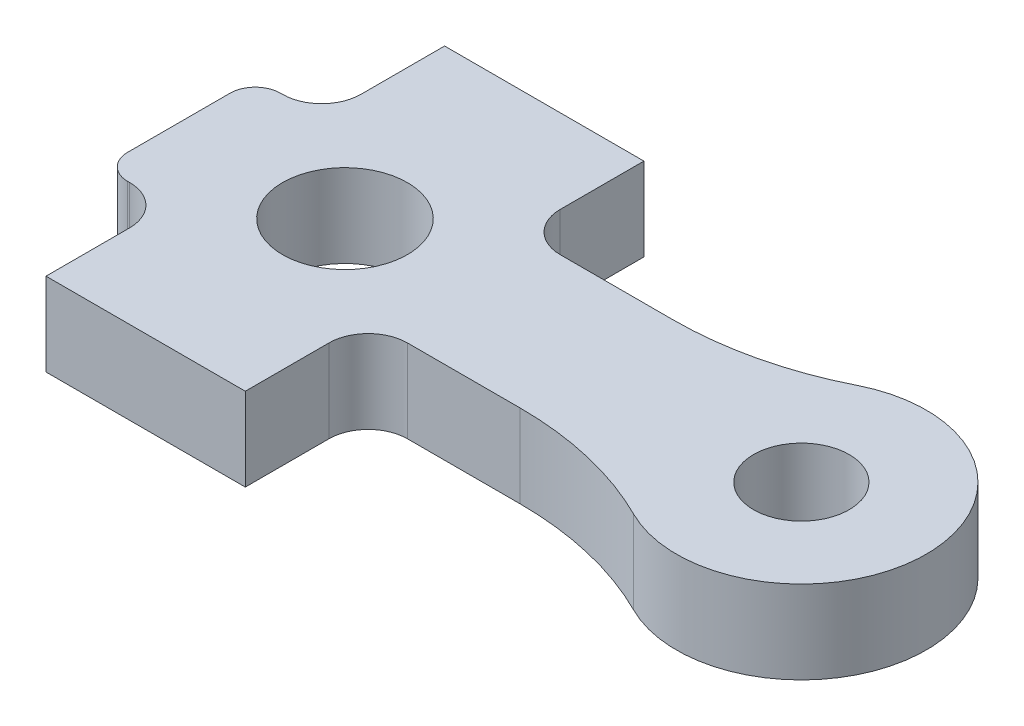
ISO-10303-21;
HEADER;
FILE_DESCRIPTION(('STEP AP214'),'2;1');
FILE_NAME('part.step','',(''),(''),'','','');
FILE_SCHEMA(('AUTOMOTIVE_DESIGN { 1 0 10303 214 1 1 1 1 }'));
ENDSEC;
DATA;
#1=APPLICATION_CONTEXT('core data for automotive mechanical design processes');
#2=APPLICATION_PROTOCOL_DEFINITION('international standard','automotive_design',2000,#1);
#3=PRODUCT_CONTEXT('',#1,'mechanical');
#4=PRODUCT('Part','Part','',(#3));
#5=PRODUCT_RELATED_PRODUCT_CATEGORY('part','',(#4));
#6=PRODUCT_DEFINITION_FORMATION('','',#4);
#7=PRODUCT_DEFINITION_CONTEXT('part definition',#1,'design');
#8=PRODUCT_DEFINITION('design','',#6,#7);
#9=PRODUCT_DEFINITION_SHAPE('','',#8);
#10=(LENGTH_UNIT() NAMED_UNIT(*) SI_UNIT(.MILLI.,.METRE.));
#11=(NAMED_UNIT(*) PLANE_ANGLE_UNIT() SI_UNIT($,.RADIAN.));
#12=(NAMED_UNIT(*) SI_UNIT($,.STERADIAN.) SOLID_ANGLE_UNIT());
#13=UNCERTAINTY_MEASURE_WITH_UNIT(LENGTH_MEASURE(1.E-05),#10,'distance_accuracy_value','');
#14=(GEOMETRIC_REPRESENTATION_CONTEXT(3) GLOBAL_UNCERTAINTY_ASSIGNED_CONTEXT((#13)) GLOBAL_UNIT_ASSIGNED_CONTEXT((#10,
#11,#12)) REPRESENTATION_CONTEXT('',''));
#15=CARTESIAN_POINT('',(0.,0.,0.));
#16=DIRECTION('',(0.,0.,1.));
#17=DIRECTION('',(1.,0.,0.));
#18=AXIS2_PLACEMENT_3D('',#15,#16,#17);
#19=CARTESIAN_POINT('',(7.9375,3.175,0.));
#20=DIRECTION('',(0.,1.,0.));
#21=DIRECTION('',(1.,0.,0.));
#22=AXIS2_PLACEMENT_3D('',#19,#20,#21);
#23=PLANE('',#22);
#24=CARTESIAN_POINT('',(17.4498,3.175,0.));
#25=DIRECTION('',(0.,-1.,0.));
#26=DIRECTION('',(1.,0.,0.));
#27=AXIS2_PLACEMENT_3D('',#24,#25,#26);
#28=CIRCLE('',#27,1.8288);
#29=CARTESIAN_POINT('',(15.621,3.175,0.));
#30=VERTEX_POINT('',#29);
#31=EDGE_CURVE('E246',#30,#30,#28,.T.);
#32=ORIENTED_EDGE('',*,*,#31,.T.);
#33=EDGE_LOOP('',(#32));
#34=FACE_BOUND('',#33,.T.);
#35=CARTESIAN_POINT('',(0.,3.175,0.));
#36=DIRECTION('',(0.,-1.,0.));
#37=DIRECTION('',(1.,0.,0.));
#38=AXIS2_PLACEMENT_3D('',#35,#36,#37);
#39=CIRCLE('',#38,2.3876);
#40=CARTESIAN_POINT('',(-2.3876,3.175,0.));
#41=VERTEX_POINT('',#40);
#42=EDGE_CURVE('E245',#41,#41,#39,.T.);
#43=ORIENTED_EDGE('',*,*,#42,.T.);
#44=EDGE_LOOP('',(#43));
#45=FACE_BOUND('',#44,.T.);
#46=CARTESIAN_POINT('',(-5.3848,3.175,-1.9558));
#47=DIRECTION('',(0.,-1.,0.));
#48=DIRECTION('',(-0.707106781186547,0.,-0.707106781186548));
#49=AXIS2_PLACEMENT_3D('',#46,#47,#48);
#50=CIRCLE('',#49,0.9652);
#51=CARTESIAN_POINT('',(-6.35,3.175,-1.9558));
#52=VERTEX_POINT('',#51);
#53=CARTESIAN_POINT('',(-5.3848,3.175,-2.921));
#54=VERTEX_POINT('',#53);
#55=EDGE_CURVE('E250',#52,#54,#50,.T.);
#56=ORIENTED_EDGE('',*,*,#55,.F.);
#57=DIRECTION('',(0.,0.,1.));
#58=VECTOR('',#57,1.);
#59=CARTESIAN_POINT('',(-6.35,3.175,-2.921));
#60=LINE('',#59,#58);
#61=CARTESIAN_POINT('',(-6.35,3.175,1.9558));
#62=VERTEX_POINT('',#61);
#63=EDGE_CURVE('E298',#52,#62,#60,.T.);
#64=ORIENTED_EDGE('',*,*,#63,.T.);
#65=CARTESIAN_POINT('',(-5.3848,3.175,1.9558));
#66=DIRECTION('',(0.,-1.,0.));
#67=DIRECTION('',(-0.707106781186547,0.,0.707106781186548));
#68=AXIS2_PLACEMENT_3D('',#65,#66,#67);
#69=CIRCLE('',#68,0.9652);
#70=CARTESIAN_POINT('',(-5.3848,3.175,2.921));
#71=VERTEX_POINT('',#70);
#72=EDGE_CURVE('E369',#71,#62,#69,.T.);
#73=ORIENTED_EDGE('',*,*,#72,.F.);
#74=DIRECTION('',(1.,0.,0.));
#75=VECTOR('',#74,1.);
#76=CARTESIAN_POINT('',(-6.35,3.175,2.921));
#77=LINE('',#76,#75);
#78=CARTESIAN_POINT('',(-5.31,3.175,2.921));
#79=VERTEX_POINT('',#78);
#80=EDGE_CURVE('E11',#71,#79,#77,.T.);
#81=ORIENTED_EDGE('',*,*,#80,.T.);
#82=CARTESIAN_POINT('',(-5.31,3.175,4.421));
#83=DIRECTION('',(0.,1.,0.));
#84=DIRECTION('',(0.707106781186548,0.,-0.707106781186548));
#85=AXIS2_PLACEMENT_3D('',#82,#83,#84);
#86=CIRCLE('',#85,1.5);
#87=CARTESIAN_POINT('',(-3.81,3.175,4.421));
#88=VERTEX_POINT('',#87);
#89=EDGE_CURVE('E419',#88,#79,#86,.T.);
#90=ORIENTED_EDGE('',*,*,#89,.F.);
#91=DIRECTION('',(0.,0.,1.));
#92=VECTOR('',#91,1.);
#93=CARTESIAN_POINT('',(-3.81,3.175,7.62));
#94=LINE('',#93,#92);
#95=CARTESIAN_POINT('',(-3.81,3.175,7.62));
#96=VERTEX_POINT('',#95);
#97=EDGE_CURVE('E240',#88,#96,#94,.T.);
#98=ORIENTED_EDGE('',*,*,#97,.T.);
#99=DIRECTION('',(1.,0.,0.));
#100=VECTOR('',#99,1.);
#101=CARTESIAN_POINT('',(3.81,3.175,7.62));
#102=LINE('',#101,#100);
#103=CARTESIAN_POINT('',(3.81,3.175,7.62));
#104=VERTEX_POINT('',#103);
#105=EDGE_CURVE('E27',#96,#104,#102,.T.);
#106=ORIENTED_EDGE('',*,*,#105,.T.);
#107=DIRECTION('',(0.,0.,-1.));
#108=VECTOR('',#107,1.);
#109=CARTESIAN_POINT('',(3.81,3.175,-7.62));
#110=LINE('',#109,#108);
#111=CARTESIAN_POINT('',(3.81,3.175,4.421));
#112=VERTEX_POINT('',#111);
#113=EDGE_CURVE('E339',#104,#112,#110,.T.);
#114=ORIENTED_EDGE('',*,*,#113,.T.);
#115=CARTESIAN_POINT('',(5.31,3.175,4.421));
#116=DIRECTION('',(0.,1.,0.));
#117=DIRECTION('',(-0.707106781186548,0.,-0.707106781186548));
#118=AXIS2_PLACEMENT_3D('',#115,#116,#117);
#119=CIRCLE('',#118,1.5);
#120=CARTESIAN_POINT('',(5.31,3.175,2.921));
#121=VERTEX_POINT('',#120);
#122=EDGE_CURVE('E320',#121,#112,#119,.T.);
#123=ORIENTED_EDGE('',*,*,#122,.F.);
#124=DIRECTION('',(1.,0.,0.));
#125=VECTOR('',#124,1.);
#126=CARTESIAN_POINT('',(-6.35,3.175,2.921));
#127=LINE('',#126,#125);
#128=CARTESIAN_POINT('',(9.61609244610192,3.175,2.921));
#129=VERTEX_POINT('',#128);
#130=EDGE_CURVE('E214',#121,#129,#127,.T.);
#131=ORIENTED_EDGE('',*,*,#130,.T.);
#132=CARTESIAN_POINT('',(9.61609244610192,3.175,15.621));
#133=DIRECTION('',(0.,1.,0.));
#134=DIRECTION('',(0.230330904529538,0.,-0.973112364744486));
#135=AXIS2_PLACEMENT_3D('',#132,#133,#134);
#136=CIRCLE('',#135,12.7);
#137=CARTESIAN_POINT('',(15.309193866086,3.175,4.26852906976744));
#138=VERTEX_POINT('',#137);
#139=EDGE_CURVE('E209',#138,#129,#136,.T.);
#140=ORIENTED_EDGE('',*,*,#139,.F.);
#141=CARTESIAN_POINT('',(17.4498,3.175,0.));
#142=DIRECTION('',(0.,1.,0.));
#143=DIRECTION('',(1.,0.,0.));
#144=AXIS2_PLACEMENT_3D('',#141,#142,#143);
#145=CIRCLE('',#144,4.7752);
#146=CARTESIAN_POINT('',(15.309193866086,3.175,-4.26852906976744));
#147=VERTEX_POINT('',#146);
#148=EDGE_CURVE('E197',#138,#147,#145,.T.);
#149=ORIENTED_EDGE('',*,*,#148,.T.);
#150=CARTESIAN_POINT('',(9.61609244610192,3.175,-15.621));
#151=DIRECTION('',(0.,1.,0.));
#152=DIRECTION('',(0.230330904529538,0.,0.973112364744486));
#153=AXIS2_PLACEMENT_3D('',#150,#151,#152);
#154=CIRCLE('',#153,12.7);
#155=CARTESIAN_POINT('',(9.61609244610192,3.175,-2.921));
#156=VERTEX_POINT('',#155);
#157=EDGE_CURVE('E329',#156,#147,#154,.T.);
#158=ORIENTED_EDGE('',*,*,#157,.F.);
#159=DIRECTION('',(-1.,0.,0.));
#160=VECTOR('',#159,1.);
#161=CARTESIAN_POINT('',(22.225,3.175,-2.921));
#162=LINE('',#161,#160);
#163=CARTESIAN_POINT('',(5.31,3.175,-2.921));
#164=VERTEX_POINT('',#163);
#165=EDGE_CURVE('E236',#156,#164,#162,.T.);
#166=ORIENTED_EDGE('',*,*,#165,.T.);
#167=CARTESIAN_POINT('',(5.31,3.175,-4.421));
#168=DIRECTION('',(0.,1.,0.));
#169=DIRECTION('',(-0.707106781186548,0.,0.707106781186548));
#170=AXIS2_PLACEMENT_3D('',#167,#168,#169);
#171=CIRCLE('',#170,1.5);
#172=CARTESIAN_POINT('',(3.81,3.175,-4.421));
#173=VERTEX_POINT('',#172);
#174=EDGE_CURVE('E267',#173,#164,#171,.T.);
#175=ORIENTED_EDGE('',*,*,#174,.F.);
#176=DIRECTION('',(0.,0.,-1.));
#177=VECTOR('',#176,1.);
#178=CARTESIAN_POINT('',(3.81,3.175,-7.62));
#179=LINE('',#178,#177);
#180=CARTESIAN_POINT('',(3.81,3.175,-7.62));
#181=VERTEX_POINT('',#180);
#182=EDGE_CURVE('E261',#173,#181,#179,.T.);
#183=ORIENTED_EDGE('',*,*,#182,.T.);
#184=DIRECTION('',(-1.,0.,0.));
#185=VECTOR('',#184,1.);
#186=CARTESIAN_POINT('',(-3.81,3.175,-7.62));
#187=LINE('',#186,#185);
#188=CARTESIAN_POINT('',(-3.81,3.175,-7.62));
#189=VERTEX_POINT('',#188);
#190=EDGE_CURVE('E292',#181,#189,#187,.T.);
#191=ORIENTED_EDGE('',*,*,#190,.T.);
#192=DIRECTION('',(0.,0.,1.));
#193=VECTOR('',#192,1.);
#194=CARTESIAN_POINT('',(-3.81,3.175,7.62));
#195=LINE('',#194,#193);
#196=CARTESIAN_POINT('',(-3.81,3.175,-4.421));
#197=VERTEX_POINT('',#196);
#198=EDGE_CURVE('E293',#189,#197,#195,.T.);
#199=ORIENTED_EDGE('',*,*,#198,.T.);
#200=CARTESIAN_POINT('',(-5.31,3.175,-4.421));
#201=DIRECTION('',(0.,1.,0.));
#202=DIRECTION('',(0.707106781186548,0.,0.707106781186548));
#203=AXIS2_PLACEMENT_3D('',#200,#201,#202);
#204=CIRCLE('',#203,1.5);
#205=CARTESIAN_POINT('',(-5.31,3.175,-2.921));
#206=VERTEX_POINT('',#205);
#207=EDGE_CURVE('E359',#206,#197,#204,.T.);
#208=ORIENTED_EDGE('',*,*,#207,.F.);
#209=DIRECTION('',(-1.,0.,0.));
#210=VECTOR('',#209,1.);
#211=CARTESIAN_POINT('',(22.225,3.175,-2.921));
#212=LINE('',#211,#210);
#213=EDGE_CURVE('E275',#206,#54,#212,.T.);
#214=ORIENTED_EDGE('',*,*,#213,.T.);
#215=EDGE_LOOP('',(#56,#64,#73,#81,#90,#98,#106,#114,#123,#131,#140,#149,#158,#166,#175,#183,
#191,#199,#208,#214));
#216=FACE_BOUND('',#215,.T.);
#217=ADVANCED_FACE('F16',(#34,#45,#216),#23,.T.);
#218=CARTESIAN_POINT('',(-6.35,0.,2.921));
#219=DIRECTION('',(0.,0.,1.));
#220=DIRECTION('',(1.,0.,0.));
#221=AXIS2_PLACEMENT_3D('',#218,#219,#220);
#222=PLANE('',#221);
#223=DIRECTION('',(0.,-1.,0.));
#224=VECTOR('',#223,1.);
#225=CARTESIAN_POINT('',(-5.31,0.,2.921));
#226=LINE('',#225,#224);
#227=CARTESIAN_POINT('',(-5.31,0.,2.921));
#228=VERTEX_POINT('',#227);
#229=EDGE_CURVE('E411',#79,#228,#226,.T.);
#230=ORIENTED_EDGE('',*,*,#229,.F.);
#231=ORIENTED_EDGE('',*,*,#80,.F.);
#232=DIRECTION('',(0.,1.,0.));
#233=VECTOR('',#232,1.);
#234=CARTESIAN_POINT('',(-5.3848,0.,2.921));
#235=LINE('',#234,#233);
#236=CARTESIAN_POINT('',(-5.3848,0.,2.921));
#237=VERTEX_POINT('',#236);
#238=EDGE_CURVE('E352',#237,#71,#235,.T.);
#239=ORIENTED_EDGE('',*,*,#238,.F.);
#240=DIRECTION('',(1.,0.,0.));
#241=VECTOR('',#240,1.);
#242=CARTESIAN_POINT('',(-6.35,0.,2.921));
#243=LINE('',#242,#241);
#244=EDGE_CURVE('E274',#237,#228,#243,.T.);
#245=ORIENTED_EDGE('',*,*,#244,.T.);
#246=EDGE_LOOP('',(#230,#231,#239,#245));
#247=FACE_BOUND('',#246,.T.);
#248=ADVANCED_FACE('F410',(#247),#222,.T.);
#249=CARTESIAN_POINT('',(-3.81,0.,7.62));
#250=DIRECTION('',(0.,0.,1.));
#251=DIRECTION('',(1.,0.,0.));
#252=AXIS2_PLACEMENT_3D('',#249,#250,#251);
#253=PLANE('',#252);
#254=DIRECTION('',(-1.,0.,0.));
#255=VECTOR('',#254,1.);
#256=CARTESIAN_POINT('',(3.81,0.,7.62));
#257=LINE('',#256,#255);
#258=CARTESIAN_POINT('',(3.81,0.,7.62));
#259=VERTEX_POINT('',#258);
#260=CARTESIAN_POINT('',(-3.81,0.,7.62));
#261=VERTEX_POINT('',#260);
#262=EDGE_CURVE('E255',#259,#261,#257,.T.);
#263=ORIENTED_EDGE('',*,*,#262,.F.);
#264=DIRECTION('',(0.,1.,0.));
#265=VECTOR('',#264,1.);
#266=CARTESIAN_POINT('',(3.81,0.,7.62));
#267=LINE('',#266,#265);
#268=EDGE_CURVE('E342',#259,#104,#267,.T.);
#269=ORIENTED_EDGE('',*,*,#268,.T.);
#270=ORIENTED_EDGE('',*,*,#105,.F.);
#271=DIRECTION('',(0.,1.,0.));
#272=VECTOR('',#271,1.);
#273=CARTESIAN_POINT('',(-3.81,0.,7.62));
#274=LINE('',#273,#272);
#275=EDGE_CURVE('E237',#261,#96,#274,.T.);
#276=ORIENTED_EDGE('',*,*,#275,.F.);
#277=EDGE_LOOP('',(#263,#269,#270,#276));
#278=FACE_BOUND('',#277,.T.);
#279=ADVANCED_FACE('F509',(#278),#253,.T.);
#280=CARTESIAN_POINT('',(3.81,0.,7.62));
#281=DIRECTION('',(1.,0.,0.));
#282=DIRECTION('',(0.,1.,0.));
#283=AXIS2_PLACEMENT_3D('',#280,#281,#282);
#284=PLANE('',#283);
#285=DIRECTION('',(0.,-1.,0.));
#286=VECTOR('',#285,1.);
#287=CARTESIAN_POINT('',(3.81,0.,4.421));
#288=LINE('',#287,#286);
#289=CARTESIAN_POINT('',(3.81,0.,4.421));
#290=VERTEX_POINT('',#289);
#291=EDGE_CURVE('E316',#112,#290,#288,.T.);
#292=ORIENTED_EDGE('',*,*,#291,.F.);
#293=ORIENTED_EDGE('',*,*,#113,.F.);
#294=ORIENTED_EDGE('',*,*,#268,.F.);
#295=DIRECTION('',(0.,0.,1.));
#296=VECTOR('',#295,1.);
#297=CARTESIAN_POINT('',(3.81,0.,-7.62));
#298=LINE('',#297,#296);
#299=EDGE_CURVE('E251',#290,#259,#298,.T.);
#300=ORIENTED_EDGE('',*,*,#299,.F.);
#301=EDGE_LOOP('',(#292,#293,#294,#300));
#302=FACE_BOUND('',#301,.T.);
#303=ADVANCED_FACE('F505',(#302),#284,.T.);
#304=CARTESIAN_POINT('',(3.81,0.,-7.62));
#305=DIRECTION('',(0.,0.,-1.));
#306=DIRECTION('',(0.,-1.,0.));
#307=AXIS2_PLACEMENT_3D('',#304,#305,#306);
#308=PLANE('',#307);
#309=DIRECTION('',(1.,0.,0.));
#310=VECTOR('',#309,1.);
#311=CARTESIAN_POINT('',(-3.81,0.,-7.62));
#312=LINE('',#311,#310);
#313=CARTESIAN_POINT('',(-3.81,0.,-7.62));
#314=VERTEX_POINT('',#313);
#315=CARTESIAN_POINT('',(3.81,0.,-7.62));
#316=VERTEX_POINT('',#315);
#317=EDGE_CURVE('E256',#314,#316,#312,.T.);
#318=ORIENTED_EDGE('',*,*,#317,.F.);
#319=DIRECTION('',(0.,1.,0.));
#320=VECTOR('',#319,1.);
#321=CARTESIAN_POINT('',(-3.81,0.,-7.62));
#322=LINE('',#321,#320);
#323=EDGE_CURVE('E288',#314,#189,#322,.T.);
#324=ORIENTED_EDGE('',*,*,#323,.T.);
#325=ORIENTED_EDGE('',*,*,#190,.F.);
#326=DIRECTION('',(0.,1.,0.));
#327=VECTOR('',#326,1.);
#328=CARTESIAN_POINT('',(3.81,0.,-7.62));
#329=LINE('',#328,#327);
#330=EDGE_CURVE('E257',#316,#181,#329,.T.);
#331=ORIENTED_EDGE('',*,*,#330,.F.);
#332=EDGE_LOOP('',(#318,#324,#325,#331));
#333=FACE_BOUND('',#332,.T.);
#334=ADVANCED_FACE('F508',(#333),#308,.T.);
#335=CARTESIAN_POINT('',(-3.81,0.,-7.62));
#336=DIRECTION('',(-1.,0.,0.));
#337=DIRECTION('',(0.,0.,1.));
#338=AXIS2_PLACEMENT_3D('',#335,#336,#337);
#339=PLANE('',#338);
#340=DIRECTION('',(0.,-1.,0.));
#341=VECTOR('',#340,1.);
#342=CARTESIAN_POINT('',(-3.81,0.,-4.421));
#343=LINE('',#342,#341);
#344=CARTESIAN_POINT('',(-3.81,0.,-4.421));
#345=VERTEX_POINT('',#344);
#346=EDGE_CURVE('E325',#197,#345,#343,.T.);
#347=ORIENTED_EDGE('',*,*,#346,.F.);
#348=ORIENTED_EDGE('',*,*,#198,.F.);
#349=ORIENTED_EDGE('',*,*,#323,.F.);
#350=DIRECTION('',(0.,0.,-1.));
#351=VECTOR('',#350,1.);
#352=CARTESIAN_POINT('',(-3.81,0.,7.62));
#353=LINE('',#352,#351);
#354=EDGE_CURVE('E294',#345,#314,#353,.T.);
#355=ORIENTED_EDGE('',*,*,#354,.F.);
#356=EDGE_LOOP('',(#347,#348,#349,#355));
#357=FACE_BOUND('',#356,.T.);
#358=ADVANCED_FACE('F546',(#357),#339,.T.);
#359=CARTESIAN_POINT('',(0.,0.,0.));
#360=DIRECTION('',(0.,1.,0.));
#361=DIRECTION('',(1.,0.,0.));
#362=AXIS2_PLACEMENT_3D('',#359,#360,#361);
#363=CYLINDRICAL_SURFACE('',#362,2.3876);
#364=ORIENTED_EDGE('',*,*,#42,.F.);
#365=DIRECTION('',(0.,-1.,0.));
#366=VECTOR('',#365,1.);
#367=CARTESIAN_POINT('',(-2.3876,0.,0.));
#368=LINE('',#367,#366);
#369=CARTESIAN_POINT('',(-2.3876,0.,0.));
#370=VERTEX_POINT('',#369);
#371=EDGE_CURVE('E326',#41,#370,#368,.T.);
#372=ORIENTED_EDGE('',*,*,#371,.T.);
#373=CARTESIAN_POINT('',(0.,0.,0.));
#374=DIRECTION('',(0.,-1.,0.));
#375=DIRECTION('',(1.,0.,0.));
#376=AXIS2_PLACEMENT_3D('',#373,#374,#375);
#377=CIRCLE('',#376,2.3876);
#378=EDGE_CURVE('E273',#370,#370,#377,.T.);
#379=ORIENTED_EDGE('',*,*,#378,.T.);
#380=ORIENTED_EDGE('',*,*,#371,.F.);
#381=EDGE_LOOP('',(#364,#372,#379,#380));
#382=FACE_BOUND('',#381,.T.);
#383=ADVANCED_FACE('F483',(#382),#363,.F.);
#384=CARTESIAN_POINT('',(17.4498,0.,0.));
#385=DIRECTION('',(0.,1.,0.));
#386=DIRECTION('',(1.,0.,0.));
#387=AXIS2_PLACEMENT_3D('',#384,#385,#386);
#388=CYLINDRICAL_SURFACE('',#387,1.8288);
#389=ORIENTED_EDGE('',*,*,#31,.F.);
#390=DIRECTION('',(0.,-1.,0.));
#391=VECTOR('',#390,1.);
#392=CARTESIAN_POINT('',(15.621,0.,0.));
#393=LINE('',#392,#391);
#394=CARTESIAN_POINT('',(15.621,0.,0.));
#395=VERTEX_POINT('',#394);
#396=EDGE_CURVE('E242',#30,#395,#393,.T.);
#397=ORIENTED_EDGE('',*,*,#396,.T.);
#398=CARTESIAN_POINT('',(17.4498,0.,0.));
#399=DIRECTION('',(0.,-1.,0.));
#400=DIRECTION('',(1.,0.,0.));
#401=AXIS2_PLACEMENT_3D('',#398,#399,#400);
#402=CIRCLE('',#401,1.8288);
#403=EDGE_CURVE('E356',#395,#395,#402,.T.);
#404=ORIENTED_EDGE('',*,*,#403,.T.);
#405=ORIENTED_EDGE('',*,*,#396,.F.);
#406=EDGE_LOOP('',(#389,#397,#404,#405));
#407=FACE_BOUND('',#406,.T.);
#408=ADVANCED_FACE('F475',(#407),#388,.F.);
#409=CARTESIAN_POINT('',(-5.3848,0.,1.9558));
#410=DIRECTION('',(0.,1.,0.));
#411=DIRECTION('',(-0.707106781186547,0.,0.707106781186548));
#412=AXIS2_PLACEMENT_3D('',#409,#410,#411);
#413=CYLINDRICAL_SURFACE('',#412,0.9652);
#414=ORIENTED_EDGE('',*,*,#72,.T.);
#415=DIRECTION('',(0.,-1.,0.));
#416=VECTOR('',#415,1.);
#417=CARTESIAN_POINT('',(-6.35,0.,1.9558));
#418=LINE('',#417,#416);
#419=CARTESIAN_POINT('',(-6.35,0.,1.9558));
#420=VERTEX_POINT('',#419);
#421=EDGE_CURVE('E303',#62,#420,#418,.T.);
#422=ORIENTED_EDGE('',*,*,#421,.T.);
#423=CARTESIAN_POINT('',(-5.3848,0.,1.9558));
#424=DIRECTION('',(0.,1.,0.));
#425=DIRECTION('',(-0.707106781186547,0.,0.707106781186548));
#426=AXIS2_PLACEMENT_3D('',#423,#424,#425);
#427=CIRCLE('',#426,0.9652);
#428=EDGE_CURVE('E269',#420,#237,#427,.T.);
#429=ORIENTED_EDGE('',*,*,#428,.T.);
#430=ORIENTED_EDGE('',*,*,#238,.T.);
#431=EDGE_LOOP('',(#414,#422,#429,#430));
#432=FACE_BOUND('',#431,.T.);
#433=ADVANCED_FACE('F488',(#432),#413,.T.);
#434=CARTESIAN_POINT('',(7.9375,0.,0.));
#435=DIRECTION('',(0.,1.,0.));
#436=DIRECTION('',(1.,0.,0.));
#437=AXIS2_PLACEMENT_3D('',#434,#435,#436);
#438=PLANE('',#437);
#439=ORIENTED_EDGE('',*,*,#403,.F.);
#440=EDGE_LOOP('',(#439));
#441=FACE_BOUND('',#440,.T.);
#442=ORIENTED_EDGE('',*,*,#378,.F.);
#443=EDGE_LOOP('',(#442));
#444=FACE_BOUND('',#443,.T.);
#445=CARTESIAN_POINT('',(-5.3848,0.,-1.9558));
#446=DIRECTION('',(0.,1.,0.));
#447=DIRECTION('',(-0.707106781186547,0.,-0.707106781186548));
#448=AXIS2_PLACEMENT_3D('',#445,#446,#447);
#449=CIRCLE('',#448,0.9652);
#450=CARTESIAN_POINT('',(-5.3848,0.,-2.921));
#451=VERTEX_POINT('',#450);
#452=CARTESIAN_POINT('',(-6.35,0.,-1.9558));
#453=VERTEX_POINT('',#452);
#454=EDGE_CURVE('E283',#451,#453,#449,.T.);
#455=ORIENTED_EDGE('',*,*,#454,.F.);
#456=DIRECTION('',(-1.,0.,0.));
#457=VECTOR('',#456,1.);
#458=CARTESIAN_POINT('',(22.225,0.,-2.921));
#459=LINE('',#458,#457);
#460=CARTESIAN_POINT('',(-5.31,0.,-2.921));
#461=VERTEX_POINT('',#460);
#462=EDGE_CURVE('E321',#461,#451,#459,.T.);
#463=ORIENTED_EDGE('',*,*,#462,.F.);
#464=CARTESIAN_POINT('',(-5.31,0.,-4.421));
#465=DIRECTION('',(0.,-1.,0.));
#466=DIRECTION('',(0.707106781186548,0.,0.707106781186548));
#467=AXIS2_PLACEMENT_3D('',#464,#465,#466);
#468=CIRCLE('',#467,1.5);
#469=EDGE_CURVE('E233',#345,#461,#468,.T.);
#470=ORIENTED_EDGE('',*,*,#469,.F.);
#471=ORIENTED_EDGE('',*,*,#354,.T.);
#472=ORIENTED_EDGE('',*,*,#317,.T.);
#473=DIRECTION('',(0.,0.,1.));
#474=VECTOR('',#473,1.);
#475=CARTESIAN_POINT('',(3.81,0.,-7.62));
#476=LINE('',#475,#474);
#477=CARTESIAN_POINT('',(3.81,0.,-4.421));
#478=VERTEX_POINT('',#477);
#479=EDGE_CURVE('E262',#316,#478,#476,.T.);
#480=ORIENTED_EDGE('',*,*,#479,.T.);
#481=CARTESIAN_POINT('',(5.31,0.,-4.421));
#482=DIRECTION('',(0.,-1.,0.));
#483=DIRECTION('',(-0.707106781186548,0.,0.707106781186548));
#484=AXIS2_PLACEMENT_3D('',#481,#482,#483);
#485=CIRCLE('',#484,1.5);
#486=CARTESIAN_POINT('',(5.31,0.,-2.921));
#487=VERTEX_POINT('',#486);
#488=EDGE_CURVE('E268',#487,#478,#485,.T.);
#489=ORIENTED_EDGE('',*,*,#488,.F.);
#490=DIRECTION('',(-1.,0.,0.));
#491=VECTOR('',#490,1.);
#492=CARTESIAN_POINT('',(22.225,0.,-2.921));
#493=LINE('',#492,#491);
#494=CARTESIAN_POINT('',(9.61609244610192,0.,-2.921));
#495=VERTEX_POINT('',#494);
#496=EDGE_CURVE('E229',#495,#487,#493,.T.);
#497=ORIENTED_EDGE('',*,*,#496,.F.);
#498=CARTESIAN_POINT('',(9.61609244610192,0.,-15.621));
#499=DIRECTION('',(0.,-1.,0.));
#500=DIRECTION('',(0.230330904529538,0.,0.973112364744486));
#501=AXIS2_PLACEMENT_3D('',#498,#499,#500);
#502=CIRCLE('',#501,12.7);
#503=CARTESIAN_POINT('',(15.309193866086,0.,-4.26852906976744));
#504=VERTEX_POINT('',#503);
#505=EDGE_CURVE('E282',#504,#495,#502,.T.);
#506=ORIENTED_EDGE('',*,*,#505,.F.);
#507=CARTESIAN_POINT('',(17.4498,0.,0.));
#508=DIRECTION('',(0.,1.,0.));
#509=DIRECTION('',(1.,0.,0.));
#510=AXIS2_PLACEMENT_3D('',#507,#508,#509);
#511=CIRCLE('',#510,4.7752);
#512=CARTESIAN_POINT('',(15.309193866086,0.,4.26852906976744));
#513=VERTEX_POINT('',#512);
#514=EDGE_CURVE('E208',#513,#504,#511,.T.);
#515=ORIENTED_EDGE('',*,*,#514,.F.);
#516=CARTESIAN_POINT('',(9.61609244610192,0.,15.621));
#517=DIRECTION('',(0.,-1.,0.));
#518=DIRECTION('',(0.230330904529538,0.,-0.973112364744486));
#519=AXIS2_PLACEMENT_3D('',#516,#517,#518);
#520=CIRCLE('',#519,12.7);
#521=CARTESIAN_POINT('',(9.61609244610192,0.,2.921));
#522=VERTEX_POINT('',#521);
#523=EDGE_CURVE('E222',#522,#513,#520,.T.);
#524=ORIENTED_EDGE('',*,*,#523,.F.);
#525=DIRECTION('',(1.,0.,0.));
#526=VECTOR('',#525,1.);
#527=CARTESIAN_POINT('',(-6.35,0.,2.921));
#528=LINE('',#527,#526);
#529=CARTESIAN_POINT('',(5.31,0.,2.921));
#530=VERTEX_POINT('',#529);
#531=EDGE_CURVE('E311',#530,#522,#528,.T.);
#532=ORIENTED_EDGE('',*,*,#531,.F.);
#533=CARTESIAN_POINT('',(5.31,0.,4.421));
#534=DIRECTION('',(0.,-1.,0.));
#535=DIRECTION('',(-0.707106781186548,0.,-0.707106781186548));
#536=AXIS2_PLACEMENT_3D('',#533,#534,#535);
#537=CIRCLE('',#536,1.5);
#538=EDGE_CURVE('E444',#290,#530,#537,.T.);
#539=ORIENTED_EDGE('',*,*,#538,.F.);
#540=ORIENTED_EDGE('',*,*,#299,.T.);
#541=ORIENTED_EDGE('',*,*,#262,.T.);
#542=DIRECTION('',(0.,0.,-1.));
#543=VECTOR('',#542,1.);
#544=CARTESIAN_POINT('',(-3.81,0.,7.62));
#545=LINE('',#544,#543);
#546=CARTESIAN_POINT('',(-3.81,0.,4.421));
#547=VERTEX_POINT('',#546);
#548=EDGE_CURVE('E20',#261,#547,#545,.T.);
#549=ORIENTED_EDGE('',*,*,#548,.T.);
#550=CARTESIAN_POINT('',(-5.31,0.,4.421));
#551=DIRECTION('',(0.,-1.,0.));
#552=DIRECTION('',(0.707106781186548,0.,-0.707106781186548));
#553=AXIS2_PLACEMENT_3D('',#550,#551,#552);
#554=CIRCLE('',#553,1.5);
#555=EDGE_CURVE('E380',#228,#547,#554,.T.);
#556=ORIENTED_EDGE('',*,*,#555,.F.);
#557=ORIENTED_EDGE('',*,*,#244,.F.);
#558=ORIENTED_EDGE('',*,*,#428,.F.);
#559=DIRECTION('',(0.,0.,1.));
#560=VECTOR('',#559,1.);
#561=CARTESIAN_POINT('',(-6.35,0.,-2.921));
#562=LINE('',#561,#560);
#563=EDGE_CURVE('E299',#453,#420,#562,.T.);
#564=ORIENTED_EDGE('',*,*,#563,.F.);
#565=EDGE_LOOP('',(#455,#463,#470,#471,#472,#480,#489,#497,#506,#515,#524,#532,#539,#540,#541,
#549,#556,#557,#558,#564));
#566=FACE_BOUND('',#565,.T.);
#567=ADVANCED_FACE('F422',(#441,#444,#566),#438,.F.);
#568=CARTESIAN_POINT('',(-6.35,0.,-2.921));
#569=DIRECTION('',(-1.,0.,0.));
#570=DIRECTION('',(0.,0.,1.));
#571=AXIS2_PLACEMENT_3D('',#568,#569,#570);
#572=PLANE('',#571);
#573=DIRECTION('',(0.,1.,0.));
#574=VECTOR('',#573,1.);
#575=CARTESIAN_POINT('',(-6.35,0.,-1.9558));
#576=LINE('',#575,#574);
#577=EDGE_CURVE('E287',#453,#52,#576,.T.);
#578=ORIENTED_EDGE('',*,*,#577,.F.);
#579=ORIENTED_EDGE('',*,*,#563,.T.);
#580=ORIENTED_EDGE('',*,*,#421,.F.);
#581=ORIENTED_EDGE('',*,*,#63,.F.);
#582=EDGE_LOOP('',(#578,#579,#580,#581));
#583=FACE_BOUND('',#582,.T.);
#584=ADVANCED_FACE('F487',(#583),#572,.T.);
#585=CARTESIAN_POINT('',(-5.3848,0.,-1.9558));
#586=DIRECTION('',(0.,1.,0.));
#587=DIRECTION('',(-0.707106781186547,0.,-0.707106781186548));
#588=AXIS2_PLACEMENT_3D('',#585,#586,#587);
#589=CYLINDRICAL_SURFACE('',#588,0.9652);
#590=ORIENTED_EDGE('',*,*,#55,.T.);
#591=DIRECTION('',(0.,-1.,0.));
#592=VECTOR('',#591,1.);
#593=CARTESIAN_POINT('',(-5.3848,0.,-2.921));
#594=LINE('',#593,#592);
#595=EDGE_CURVE('E279',#54,#451,#594,.T.);
#596=ORIENTED_EDGE('',*,*,#595,.T.);
#597=ORIENTED_EDGE('',*,*,#454,.T.);
#598=ORIENTED_EDGE('',*,*,#577,.T.);
#599=EDGE_LOOP('',(#590,#596,#597,#598));
#600=FACE_BOUND('',#599,.T.);
#601=ADVANCED_FACE('F496',(#600),#589,.T.);
#602=CARTESIAN_POINT('',(17.4498,0.,0.));
#603=DIRECTION('',(0.,1.,0.));
#604=DIRECTION('',(1.,0.,0.));
#605=AXIS2_PLACEMENT_3D('',#602,#603,#604);
#606=CYLINDRICAL_SURFACE('',#605,4.7752);
#607=DIRECTION('',(0.,-1.,0.));
#608=VECTOR('',#607,1.);
#609=CARTESIAN_POINT('',(15.309193866086,0.,-4.26852906976744));
#610=LINE('',#609,#608);
#611=EDGE_CURVE('E204',#147,#504,#610,.T.);
#612=ORIENTED_EDGE('',*,*,#611,.F.);
#613=ORIENTED_EDGE('',*,*,#148,.F.);
#614=DIRECTION('',(0.,1.,0.));
#615=VECTOR('',#614,1.);
#616=CARTESIAN_POINT('',(15.309193866086,0.,4.26852906976744));
#617=LINE('',#616,#615);
#618=EDGE_CURVE('E201',#513,#138,#617,.T.);
#619=ORIENTED_EDGE('',*,*,#618,.F.);
#620=ORIENTED_EDGE('',*,*,#514,.T.);
#621=EDGE_LOOP('',(#612,#613,#619,#620));
#622=FACE_BOUND('',#621,.T.);
#623=ADVANCED_FACE('F199',(#622),#606,.T.);
#624=CARTESIAN_POINT('',(9.61609244610192,0.,15.621));
#625=DIRECTION('',(0.,1.,0.));
#626=DIRECTION('',(0.230330904529538,0.,-0.973112364744486));
#627=AXIS2_PLACEMENT_3D('',#624,#625,#626);
#628=CYLINDRICAL_SURFACE('',#627,12.7);
#629=ORIENTED_EDGE('',*,*,#523,.T.);
#630=ORIENTED_EDGE('',*,*,#618,.T.);
#631=ORIENTED_EDGE('',*,*,#139,.T.);
#632=DIRECTION('',(0.,-1.,0.));
#633=VECTOR('',#632,1.);
#634=CARTESIAN_POINT('',(9.61609244610192,0.,2.921));
#635=LINE('',#634,#633);
#636=EDGE_CURVE('E315',#129,#522,#635,.T.);
#637=ORIENTED_EDGE('',*,*,#636,.T.);
#638=EDGE_LOOP('',(#629,#630,#631,#637));
#639=FACE_BOUND('',#638,.T.);
#640=ADVANCED_FACE('F220',(#639),#628,.F.);
#641=CARTESIAN_POINT('',(13.6721957274484,0.,-2.921));
#642=DIRECTION('',(0.,0.,-1.));
#643=DIRECTION('',(0.,-1.,0.));
#644=AXIS2_PLACEMENT_3D('',#641,#642,#643);
#645=PLANE('',#644);
#646=DIRECTION('',(0.,-1.,0.));
#647=VECTOR('',#646,1.);
#648=CARTESIAN_POINT('',(5.31,0.,-2.921));
#649=LINE('',#648,#647);
#650=EDGE_CURVE('E343',#164,#487,#649,.T.);
#651=ORIENTED_EDGE('',*,*,#650,.F.);
#652=ORIENTED_EDGE('',*,*,#165,.F.);
#653=DIRECTION('',(0.,1.,0.));
#654=VECTOR('',#653,1.);
#655=CARTESIAN_POINT('',(9.61609244610192,0.,-2.921));
#656=LINE('',#655,#654);
#657=EDGE_CURVE('E310',#495,#156,#656,.T.);
#658=ORIENTED_EDGE('',*,*,#657,.F.);
#659=ORIENTED_EDGE('',*,*,#496,.T.);
#660=EDGE_LOOP('',(#651,#652,#658,#659));
#661=FACE_BOUND('',#660,.T.);
#662=ADVANCED_FACE('F459',(#661),#645,.T.);
#663=CARTESIAN_POINT('',(9.61609244610192,0.,-15.621));
#664=DIRECTION('',(0.,1.,0.));
#665=DIRECTION('',(0.230330904529538,0.,0.973112364744486));
#666=AXIS2_PLACEMENT_3D('',#663,#664,#665);
#667=CYLINDRICAL_SURFACE('',#666,12.7);
#668=ORIENTED_EDGE('',*,*,#505,.T.);
#669=ORIENTED_EDGE('',*,*,#657,.T.);
#670=ORIENTED_EDGE('',*,*,#157,.T.);
#671=ORIENTED_EDGE('',*,*,#611,.T.);
#672=EDGE_LOOP('',(#668,#669,#670,#671));
#673=FACE_BOUND('',#672,.T.);
#674=ADVANCED_FACE('F503',(#673),#667,.F.);
#675=CARTESIAN_POINT('',(-3.81,0.,2.921));
#676=DIRECTION('',(-1.,0.,0.));
#677=DIRECTION('',(0.,0.,1.));
#678=AXIS2_PLACEMENT_3D('',#675,#676,#677);
#679=PLANE('',#678);
#680=DIRECTION('',(0.,1.,0.));
#681=VECTOR('',#680,1.);
#682=CARTESIAN_POINT('',(-3.81,0.,4.421));
#683=LINE('',#682,#681);
#684=EDGE_CURVE('E389',#547,#88,#683,.T.);
#685=ORIENTED_EDGE('',*,*,#684,.F.);
#686=ORIENTED_EDGE('',*,*,#548,.F.);
#687=ORIENTED_EDGE('',*,*,#275,.T.);
#688=ORIENTED_EDGE('',*,*,#97,.F.);
#689=EDGE_LOOP('',(#685,#686,#687,#688));
#690=FACE_BOUND('',#689,.T.);
#691=ADVANCED_FACE('F428',(#690),#679,.T.);
#692=CARTESIAN_POINT('',(-5.31,0.,4.421));
#693=DIRECTION('',(0.,1.,0.));
#694=DIRECTION('',(0.707106781186548,0.,-0.707106781186548));
#695=AXIS2_PLACEMENT_3D('',#692,#693,#694);
#696=CYLINDRICAL_SURFACE('',#695,1.5);
#697=ORIENTED_EDGE('',*,*,#555,.T.);
#698=ORIENTED_EDGE('',*,*,#684,.T.);
#699=ORIENTED_EDGE('',*,*,#89,.T.);
#700=ORIENTED_EDGE('',*,*,#229,.T.);
#701=EDGE_LOOP('',(#697,#698,#699,#700));
#702=FACE_BOUND('',#701,.T.);
#703=ADVANCED_FACE('F416',(#702),#696,.F.);
#704=CARTESIAN_POINT('',(3.81,0.,2.921));
#705=DIRECTION('',(0.,0.,1.));
#706=DIRECTION('',(1.,0.,0.));
#707=AXIS2_PLACEMENT_3D('',#704,#705,#706);
#708=PLANE('',#707);
#709=DIRECTION('',(0.,1.,0.));
#710=VECTOR('',#709,1.);
#711=CARTESIAN_POINT('',(5.31,0.,2.921));
#712=LINE('',#711,#710);
#713=EDGE_CURVE('E338',#530,#121,#712,.T.);
#714=ORIENTED_EDGE('',*,*,#713,.F.);
#715=ORIENTED_EDGE('',*,*,#531,.T.);
#716=ORIENTED_EDGE('',*,*,#636,.F.);
#717=ORIENTED_EDGE('',*,*,#130,.F.);
#718=EDGE_LOOP('',(#714,#715,#716,#717));
#719=FACE_BOUND('',#718,.T.);
#720=ADVANCED_FACE('F518',(#719),#708,.T.);
#721=CARTESIAN_POINT('',(5.31,0.,4.421));
#722=DIRECTION('',(0.,1.,0.));
#723=DIRECTION('',(-0.707106781186548,0.,-0.707106781186548));
#724=AXIS2_PLACEMENT_3D('',#721,#722,#723);
#725=CYLINDRICAL_SURFACE('',#724,1.5);
#726=ORIENTED_EDGE('',*,*,#538,.T.);
#727=ORIENTED_EDGE('',*,*,#713,.T.);
#728=ORIENTED_EDGE('',*,*,#122,.T.);
#729=ORIENTED_EDGE('',*,*,#291,.T.);
#730=EDGE_LOOP('',(#726,#727,#728,#729));
#731=FACE_BOUND('',#730,.T.);
#732=ADVANCED_FACE('F516',(#731),#725,.F.);
#733=CARTESIAN_POINT('',(3.81,0.,-2.921));
#734=DIRECTION('',(1.,0.,0.));
#735=DIRECTION('',(0.,1.,0.));
#736=AXIS2_PLACEMENT_3D('',#733,#734,#735);
#737=PLANE('',#736);
#738=DIRECTION('',(0.,1.,0.));
#739=VECTOR('',#738,1.);
#740=CARTESIAN_POINT('',(3.81,0.,-4.421));
#741=LINE('',#740,#739);
#742=EDGE_CURVE('E263',#478,#173,#741,.T.);
#743=ORIENTED_EDGE('',*,*,#742,.F.);
#744=ORIENTED_EDGE('',*,*,#479,.F.);
#745=ORIENTED_EDGE('',*,*,#330,.T.);
#746=ORIENTED_EDGE('',*,*,#182,.F.);
#747=EDGE_LOOP('',(#743,#744,#745,#746));
#748=FACE_BOUND('',#747,.T.);
#749=ADVANCED_FACE('F513',(#748),#737,.T.);
#750=CARTESIAN_POINT('',(5.31,0.,-4.421));
#751=DIRECTION('',(0.,1.,0.));
#752=DIRECTION('',(-0.707106781186548,0.,0.707106781186548));
#753=AXIS2_PLACEMENT_3D('',#750,#751,#752);
#754=CYLINDRICAL_SURFACE('',#753,1.5);
#755=ORIENTED_EDGE('',*,*,#488,.T.);
#756=ORIENTED_EDGE('',*,*,#742,.T.);
#757=ORIENTED_EDGE('',*,*,#174,.T.);
#758=ORIENTED_EDGE('',*,*,#650,.T.);
#759=EDGE_LOOP('',(#755,#756,#757,#758));
#760=FACE_BOUND('',#759,.T.);
#761=ADVANCED_FACE('F18',(#760),#754,.F.);
#762=CARTESIAN_POINT('',(-3.81,0.,-2.921));
#763=DIRECTION('',(0.,0.,-1.));
#764=DIRECTION('',(0.,-1.,0.));
#765=AXIS2_PLACEMENT_3D('',#762,#763,#764);
#766=PLANE('',#765);
#767=DIRECTION('',(0.,1.,0.));
#768=VECTOR('',#767,1.);
#769=CARTESIAN_POINT('',(-5.31,0.,-2.921));
#770=LINE('',#769,#768);
#771=EDGE_CURVE('E363',#461,#206,#770,.T.);
#772=ORIENTED_EDGE('',*,*,#771,.F.);
#773=ORIENTED_EDGE('',*,*,#462,.T.);
#774=ORIENTED_EDGE('',*,*,#595,.F.);
#775=ORIENTED_EDGE('',*,*,#213,.F.);
#776=EDGE_LOOP('',(#772,#773,#774,#775));
#777=FACE_BOUND('',#776,.T.);
#778=ADVANCED_FACE('F536',(#777),#766,.T.);
#779=CARTESIAN_POINT('',(-5.31,0.,-4.421));
#780=DIRECTION('',(0.,1.,0.));
#781=DIRECTION('',(0.707106781186548,0.,0.707106781186548));
#782=AXIS2_PLACEMENT_3D('',#779,#780,#781);
#783=CYLINDRICAL_SURFACE('',#782,1.5);
#784=ORIENTED_EDGE('',*,*,#469,.T.);
#785=ORIENTED_EDGE('',*,*,#771,.T.);
#786=ORIENTED_EDGE('',*,*,#207,.T.);
#787=ORIENTED_EDGE('',*,*,#346,.T.);
#788=EDGE_LOOP('',(#784,#785,#786,#787));
#789=FACE_BOUND('',#788,.T.);
#790=ADVANCED_FACE('F537',(#789),#783,.F.);
#791=CLOSED_SHELL('',(#217,#248,#279,#303,#334,#358,#383,#408,#433,#567,#584,#601,#623,#640,
#662,#674,#691,#703,#720,#732,#749,#761,#778,#790));
#792=MANIFOLD_SOLID_BREP('B1',#791);
#793=ADVANCED_BREP_SHAPE_REPRESENTATION('',(#18,#792),#14);
#794=SHAPE_DEFINITION_REPRESENTATION(#9,#793);
ENDSEC;
END-ISO-10303-21;
